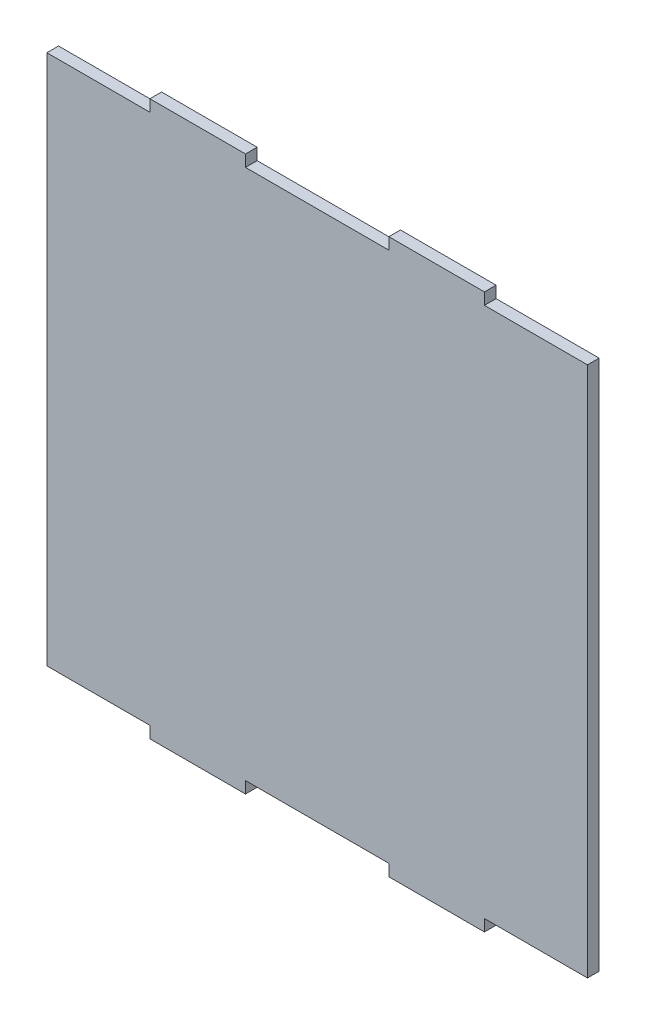
ISO-10303-21;
HEADER;
FILE_DESCRIPTION(('STEP AP214'),'2;1');
FILE_NAME('part.step','',(''),(''),'','','');
FILE_SCHEMA(('AUTOMOTIVE_DESIGN { 1 0 10303 214 1 1 1 1 }'));
ENDSEC;
DATA;
#1=APPLICATION_CONTEXT('core data for automotive mechanical design processes');
#2=APPLICATION_PROTOCOL_DEFINITION('international standard','automotive_design',2000,#1);
#3=PRODUCT_CONTEXT('',#1,'mechanical');
#4=PRODUCT('Part','Part','',(#3));
#5=PRODUCT_RELATED_PRODUCT_CATEGORY('part','',(#4));
#6=PRODUCT_DEFINITION_FORMATION('','',#4);
#7=PRODUCT_DEFINITION_CONTEXT('part definition',#1,'design');
#8=PRODUCT_DEFINITION('design','',#6,#7);
#9=PRODUCT_DEFINITION_SHAPE('','',#8);
#10=(LENGTH_UNIT() NAMED_UNIT(*) SI_UNIT(.MILLI.,.METRE.));
#11=(NAMED_UNIT(*) PLANE_ANGLE_UNIT() SI_UNIT($,.RADIAN.));
#12=(NAMED_UNIT(*) SI_UNIT($,.STERADIAN.) SOLID_ANGLE_UNIT());
#13=UNCERTAINTY_MEASURE_WITH_UNIT(LENGTH_MEASURE(1.E-05),#10,'distance_accuracy_value','');
#14=(GEOMETRIC_REPRESENTATION_CONTEXT(3) GLOBAL_UNCERTAINTY_ASSIGNED_CONTEXT((#13)) GLOBAL_UNIT_ASSIGNED_CONTEXT((#10,
#11,#12)) REPRESENTATION_CONTEXT('',''));
#15=CARTESIAN_POINT('',(0.,0.,0.));
#16=DIRECTION('',(0.,0.,1.));
#17=DIRECTION('',(1.,0.,0.));
#18=AXIS2_PLACEMENT_3D('',#15,#16,#17);
#19=CARTESIAN_POINT('',(35.,55.56,2.44));
#20=DIRECTION('',(0.,-1.,0.));
#21=DIRECTION('',(0.,0.,-1.));
#22=AXIS2_PLACEMENT_3D('',#19,#20,#21);
#23=PLANE('',#22);
#24=DIRECTION('',(-1.,0.,0.));
#25=VECTOR('',#24,1.);
#26=CARTESIAN_POINT('',(35.,55.56,0.));
#27=LINE('',#26,#25);
#28=CARTESIAN_POINT('',(56.56,55.56,0.));
#29=VERTEX_POINT('',#28);
#30=CARTESIAN_POINT('',(35.,55.56,0.));
#31=VERTEX_POINT('',#30);
#32=EDGE_CURVE('E202',#29,#31,#27,.T.);
#33=ORIENTED_EDGE('',*,*,#32,.T.);
#34=DIRECTION('',(0.,0.,-1.));
#35=VECTOR('',#34,1.);
#36=CARTESIAN_POINT('',(35.,55.56,2.44));
#37=LINE('',#36,#35);
#38=CARTESIAN_POINT('',(35.,55.56,2.44));
#39=VERTEX_POINT('',#38);
#40=EDGE_CURVE('E11',#39,#31,#37,.T.);
#41=ORIENTED_EDGE('',*,*,#40,.F.);
#42=DIRECTION('',(-1.,0.,0.));
#43=VECTOR('',#42,1.);
#44=CARTESIAN_POINT('',(35.,55.56,2.44));
#45=LINE('',#44,#43);
#46=CARTESIAN_POINT('',(56.56,55.56,2.44));
#47=VERTEX_POINT('',#46);
#48=EDGE_CURVE('E240',#47,#39,#45,.T.);
#49=ORIENTED_EDGE('',*,*,#48,.F.);
#50=DIRECTION('',(0.,0.,-1.));
#51=VECTOR('',#50,1.);
#52=CARTESIAN_POINT('',(56.56,55.56,2.44));
#53=LINE('',#52,#51);
#54=EDGE_CURVE('E198',#47,#29,#53,.T.);
#55=ORIENTED_EDGE('',*,*,#54,.T.);
#56=EDGE_LOOP('',(#33,#41,#49,#55));
#57=FACE_BOUND('',#56,.T.);
#58=ADVANCED_FACE('F34',(#57),#23,.F.);
#59=CARTESIAN_POINT('',(35.,58.,2.44));
#60=DIRECTION('',(-1.,0.,0.));
#61=DIRECTION('',(0.,0.,1.));
#62=AXIS2_PLACEMENT_3D('',#59,#60,#61);
#63=PLANE('',#62);
#64=DIRECTION('',(0.,1.,0.));
#65=VECTOR('',#64,1.);
#66=CARTESIAN_POINT('',(35.,58.,0.));
#67=LINE('',#66,#65);
#68=CARTESIAN_POINT('',(35.,58.,0.));
#69=VERTEX_POINT('',#68);
#70=EDGE_CURVE('E205',#31,#69,#67,.T.);
#71=ORIENTED_EDGE('',*,*,#70,.T.);
#72=DIRECTION('',(0.,0.,-1.));
#73=VECTOR('',#72,1.);
#74=CARTESIAN_POINT('',(35.,58.,2.44));
#75=LINE('',#74,#73);
#76=CARTESIAN_POINT('',(35.,58.,2.44));
#77=VERTEX_POINT('',#76);
#78=EDGE_CURVE('E42',#77,#69,#75,.T.);
#79=ORIENTED_EDGE('',*,*,#78,.F.);
#80=DIRECTION('',(0.,1.,0.));
#81=VECTOR('',#80,1.);
#82=CARTESIAN_POINT('',(35.,58.,2.44));
#83=LINE('',#82,#81);
#84=EDGE_CURVE('E129',#39,#77,#83,.T.);
#85=ORIENTED_EDGE('',*,*,#84,.F.);
#86=ORIENTED_EDGE('',*,*,#40,.T.);
#87=EDGE_LOOP('',(#71,#79,#85,#86));
#88=FACE_BOUND('',#87,.T.);
#89=ADVANCED_FACE('F358',(#88),#63,.F.);
#90=CARTESIAN_POINT('',(35.,58.,2.44));
#91=DIRECTION('',(0.,-1.,0.));
#92=DIRECTION('',(1.,0.,0.));
#93=AXIS2_PLACEMENT_3D('',#90,#91,#92);
#94=PLANE('',#93);
#95=DIRECTION('',(-1.,0.,0.));
#96=VECTOR('',#95,1.);
#97=CARTESIAN_POINT('',(35.,58.,0.));
#98=LINE('',#97,#96);
#99=CARTESIAN_POINT('',(15.,58.,0.));
#100=VERTEX_POINT('',#99);
#101=EDGE_CURVE('E207',#69,#100,#98,.T.);
#102=ORIENTED_EDGE('',*,*,#101,.T.);
#103=DIRECTION('',(0.,0.,-1.));
#104=VECTOR('',#103,1.);
#105=CARTESIAN_POINT('',(15.,58.,2.44));
#106=LINE('',#105,#104);
#107=CARTESIAN_POINT('',(15.,58.,2.44));
#108=VERTEX_POINT('',#107);
#109=EDGE_CURVE('E283',#108,#100,#106,.T.);
#110=ORIENTED_EDGE('',*,*,#109,.F.);
#111=DIRECTION('',(-1.,0.,0.));
#112=VECTOR('',#111,1.);
#113=CARTESIAN_POINT('',(35.,58.,2.44));
#114=LINE('',#113,#112);
#115=EDGE_CURVE('E291',#77,#108,#114,.T.);
#116=ORIENTED_EDGE('',*,*,#115,.F.);
#117=ORIENTED_EDGE('',*,*,#78,.T.);
#118=EDGE_LOOP('',(#102,#110,#116,#117));
#119=FACE_BOUND('',#118,.T.);
#120=ADVANCED_FACE('F289',(#119),#94,.F.);
#121=CARTESIAN_POINT('',(15.,58.,2.44));
#122=DIRECTION('',(1.,0.,0.));
#123=DIRECTION('',(0.,1.,0.));
#124=AXIS2_PLACEMENT_3D('',#121,#122,#123);
#125=PLANE('',#124);
#126=DIRECTION('',(0.,-1.,0.));
#127=VECTOR('',#126,1.);
#128=CARTESIAN_POINT('',(15.,58.,0.));
#129=LINE('',#128,#127);
#130=CARTESIAN_POINT('',(15.,55.56,0.));
#131=VERTEX_POINT('',#130);
#132=EDGE_CURVE('E209',#100,#131,#129,.T.);
#133=ORIENTED_EDGE('',*,*,#132,.T.);
#134=DIRECTION('',(0.,0.,-1.));
#135=VECTOR('',#134,1.);
#136=CARTESIAN_POINT('',(15.,55.56,2.44));
#137=LINE('',#136,#135);
#138=CARTESIAN_POINT('',(15.,55.56,2.44));
#139=VERTEX_POINT('',#138);
#140=EDGE_CURVE('E280',#139,#131,#137,.T.);
#141=ORIENTED_EDGE('',*,*,#140,.F.);
#142=DIRECTION('',(0.,-1.,0.));
#143=VECTOR('',#142,1.);
#144=CARTESIAN_POINT('',(15.,58.,2.44));
#145=LINE('',#144,#143);
#146=EDGE_CURVE('E309',#108,#139,#145,.T.);
#147=ORIENTED_EDGE('',*,*,#146,.F.);
#148=ORIENTED_EDGE('',*,*,#109,.T.);
#149=EDGE_LOOP('',(#133,#141,#147,#148));
#150=FACE_BOUND('',#149,.T.);
#151=ADVANCED_FACE('F300',(#150),#125,.F.);
#152=CARTESIAN_POINT('',(-15.,55.56,2.44));
#153=DIRECTION('',(0.,-1.,0.));
#154=DIRECTION('',(1.,0.,0.));
#155=AXIS2_PLACEMENT_3D('',#152,#153,#154);
#156=PLANE('',#155);
#157=DIRECTION('',(-1.,0.,0.));
#158=VECTOR('',#157,1.);
#159=CARTESIAN_POINT('',(-15.,55.56,0.));
#160=LINE('',#159,#158);
#161=CARTESIAN_POINT('',(-15.,55.56,0.));
#162=VERTEX_POINT('',#161);
#163=EDGE_CURVE('E211',#131,#162,#160,.T.);
#164=ORIENTED_EDGE('',*,*,#163,.T.);
#165=DIRECTION('',(0.,0.,-1.));
#166=VECTOR('',#165,1.);
#167=CARTESIAN_POINT('',(-15.,55.56,2.44));
#168=LINE('',#167,#166);
#169=CARTESIAN_POINT('',(-15.,55.56,2.44));
#170=VERTEX_POINT('',#169);
#171=EDGE_CURVE('E277',#170,#162,#168,.T.);
#172=ORIENTED_EDGE('',*,*,#171,.F.);
#173=DIRECTION('',(-1.,0.,0.));
#174=VECTOR('',#173,1.);
#175=CARTESIAN_POINT('',(-15.,55.56,2.44));
#176=LINE('',#175,#174);
#177=EDGE_CURVE('E306',#139,#170,#176,.T.);
#178=ORIENTED_EDGE('',*,*,#177,.F.);
#179=ORIENTED_EDGE('',*,*,#140,.T.);
#180=EDGE_LOOP('',(#164,#172,#178,#179));
#181=FACE_BOUND('',#180,.T.);
#182=ADVANCED_FACE('F304',(#181),#156,.F.);
#183=CARTESIAN_POINT('',(-14.9999999999999,58.,2.44));
#184=DIRECTION('',(-1.,0.,0.));
#185=DIRECTION('',(0.,-1.,0.));
#186=AXIS2_PLACEMENT_3D('',#183,#184,#185);
#187=PLANE('',#186);
#188=DIRECTION('',(0.,1.,0.));
#189=VECTOR('',#188,1.);
#190=CARTESIAN_POINT('',(-14.9999999999999,58.,0.));
#191=LINE('',#190,#189);
#192=CARTESIAN_POINT('',(-14.9999999999999,58.,0.));
#193=VERTEX_POINT('',#192);
#194=EDGE_CURVE('E213',#162,#193,#191,.T.);
#195=ORIENTED_EDGE('',*,*,#194,.T.);
#196=DIRECTION('',(0.,0.,-1.));
#197=VECTOR('',#196,1.);
#198=CARTESIAN_POINT('',(-14.9999999999999,58.,2.44));
#199=LINE('',#198,#197);
#200=CARTESIAN_POINT('',(-14.9999999999999,58.,2.44));
#201=VERTEX_POINT('',#200);
#202=EDGE_CURVE('E274',#201,#193,#199,.T.);
#203=ORIENTED_EDGE('',*,*,#202,.F.);
#204=DIRECTION('',(0.,1.,0.));
#205=VECTOR('',#204,1.);
#206=CARTESIAN_POINT('',(-14.9999999999999,58.,2.44));
#207=LINE('',#206,#205);
#208=EDGE_CURVE('E308',#170,#201,#207,.T.);
#209=ORIENTED_EDGE('',*,*,#208,.F.);
#210=ORIENTED_EDGE('',*,*,#171,.T.);
#211=EDGE_LOOP('',(#195,#203,#209,#210));
#212=FACE_BOUND('',#211,.T.);
#213=ADVANCED_FACE('F371',(#212),#187,.F.);
#214=CARTESIAN_POINT('',(-35.,58.,2.44));
#215=DIRECTION('',(0.,-1.,0.));
#216=DIRECTION('',(1.,0.,0.));
#217=AXIS2_PLACEMENT_3D('',#214,#215,#216);
#218=PLANE('',#217);
#219=DIRECTION('',(-1.,0.,0.));
#220=VECTOR('',#219,1.);
#221=CARTESIAN_POINT('',(-35.,58.,0.));
#222=LINE('',#221,#220);
#223=CARTESIAN_POINT('',(-35.,58.,0.));
#224=VERTEX_POINT('',#223);
#225=EDGE_CURVE('E215',#193,#224,#222,.T.);
#226=ORIENTED_EDGE('',*,*,#225,.T.);
#227=DIRECTION('',(0.,0.,-1.));
#228=VECTOR('',#227,1.);
#229=CARTESIAN_POINT('',(-35.,58.,2.44));
#230=LINE('',#229,#228);
#231=CARTESIAN_POINT('',(-35.,58.,2.44));
#232=VERTEX_POINT('',#231);
#233=EDGE_CURVE('E271',#232,#224,#230,.T.);
#234=ORIENTED_EDGE('',*,*,#233,.F.);
#235=DIRECTION('',(-1.,0.,0.));
#236=VECTOR('',#235,1.);
#237=CARTESIAN_POINT('',(-35.,58.,2.44));
#238=LINE('',#237,#236);
#239=EDGE_CURVE('E311',#201,#232,#238,.T.);
#240=ORIENTED_EDGE('',*,*,#239,.F.);
#241=ORIENTED_EDGE('',*,*,#202,.T.);
#242=EDGE_LOOP('',(#226,#234,#240,#241));
#243=FACE_BOUND('',#242,.T.);
#244=ADVANCED_FACE('F374',(#243),#218,.F.);
#245=CARTESIAN_POINT('',(-35.,58.,2.44));
#246=DIRECTION('',(1.,0.,0.));
#247=DIRECTION('',(0.,0.,-1.));
#248=AXIS2_PLACEMENT_3D('',#245,#246,#247);
#249=PLANE('',#248);
#250=DIRECTION('',(0.,-1.,0.));
#251=VECTOR('',#250,1.);
#252=CARTESIAN_POINT('',(-35.,58.,0.));
#253=LINE('',#252,#251);
#254=CARTESIAN_POINT('',(-35.,55.56,0.));
#255=VERTEX_POINT('',#254);
#256=EDGE_CURVE('E217',#224,#255,#253,.T.);
#257=ORIENTED_EDGE('',*,*,#256,.T.);
#258=DIRECTION('',(0.,0.,-1.));
#259=VECTOR('',#258,1.);
#260=CARTESIAN_POINT('',(-35.,55.56,2.44));
#261=LINE('',#260,#259);
#262=CARTESIAN_POINT('',(-35.,55.56,2.44));
#263=VERTEX_POINT('',#262);
#264=EDGE_CURVE('E268',#263,#255,#261,.T.);
#265=ORIENTED_EDGE('',*,*,#264,.F.);
#266=DIRECTION('',(0.,-1.,0.));
#267=VECTOR('',#266,1.);
#268=CARTESIAN_POINT('',(-35.,58.,2.44));
#269=LINE('',#268,#267);
#270=EDGE_CURVE('E317',#232,#263,#269,.T.);
#271=ORIENTED_EDGE('',*,*,#270,.F.);
#272=ORIENTED_EDGE('',*,*,#233,.T.);
#273=EDGE_LOOP('',(#257,#265,#271,#272));
#274=FACE_BOUND('',#273,.T.);
#275=ADVANCED_FACE('F378',(#274),#249,.F.);
#276=CARTESIAN_POINT('',(-56.56,55.56,2.44));
#277=DIRECTION('',(0.,-1.,0.));
#278=DIRECTION('',(1.,0.,0.));
#279=AXIS2_PLACEMENT_3D('',#276,#277,#278);
#280=PLANE('',#279);
#281=DIRECTION('',(-1.,0.,0.));
#282=VECTOR('',#281,1.);
#283=CARTESIAN_POINT('',(-56.56,55.56,0.));
#284=LINE('',#283,#282);
#285=CARTESIAN_POINT('',(-56.56,55.56,0.));
#286=VERTEX_POINT('',#285);
#287=EDGE_CURVE('E219',#255,#286,#284,.T.);
#288=ORIENTED_EDGE('',*,*,#287,.T.);
#289=DIRECTION('',(0.,0.,-1.));
#290=VECTOR('',#289,1.);
#291=CARTESIAN_POINT('',(-56.56,55.56,2.44));
#292=LINE('',#291,#290);
#293=CARTESIAN_POINT('',(-56.56,55.56,2.44));
#294=VERTEX_POINT('',#293);
#295=EDGE_CURVE('E265',#294,#286,#292,.T.);
#296=ORIENTED_EDGE('',*,*,#295,.F.);
#297=DIRECTION('',(-1.,0.,0.));
#298=VECTOR('',#297,1.);
#299=CARTESIAN_POINT('',(-56.56,55.56,2.44));
#300=LINE('',#299,#298);
#301=EDGE_CURVE('E319',#263,#294,#300,.T.);
#302=ORIENTED_EDGE('',*,*,#301,.F.);
#303=ORIENTED_EDGE('',*,*,#264,.T.);
#304=EDGE_LOOP('',(#288,#296,#302,#303));
#305=FACE_BOUND('',#304,.T.);
#306=ADVANCED_FACE('F382',(#305),#280,.F.);
#307=CARTESIAN_POINT('',(-56.56,-55.56,2.44));
#308=DIRECTION('',(1.,0.,0.));
#309=DIRECTION('',(0.,0.,-1.));
#310=AXIS2_PLACEMENT_3D('',#307,#308,#309);
#311=PLANE('',#310);
#312=DIRECTION('',(0.,-1.,0.));
#313=VECTOR('',#312,1.);
#314=CARTESIAN_POINT('',(-56.56,-55.56,0.));
#315=LINE('',#314,#313);
#316=CARTESIAN_POINT('',(-56.56,-55.56,0.));
#317=VERTEX_POINT('',#316);
#318=EDGE_CURVE('E221',#286,#317,#315,.T.);
#319=ORIENTED_EDGE('',*,*,#318,.T.);
#320=DIRECTION('',(0.,0.,-1.));
#321=VECTOR('',#320,1.);
#322=CARTESIAN_POINT('',(-56.56,-55.56,2.44));
#323=LINE('',#322,#321);
#324=CARTESIAN_POINT('',(-56.56,-55.56,2.44));
#325=VERTEX_POINT('',#324);
#326=EDGE_CURVE('E262',#325,#317,#323,.T.);
#327=ORIENTED_EDGE('',*,*,#326,.F.);
#328=DIRECTION('',(0.,-1.,0.));
#329=VECTOR('',#328,1.);
#330=CARTESIAN_POINT('',(-56.56,-55.56,2.44));
#331=LINE('',#330,#329);
#332=EDGE_CURVE('E321',#294,#325,#331,.T.);
#333=ORIENTED_EDGE('',*,*,#332,.F.);
#334=ORIENTED_EDGE('',*,*,#295,.T.);
#335=EDGE_LOOP('',(#319,#327,#333,#334));
#336=FACE_BOUND('',#335,.T.);
#337=ADVANCED_FACE('F386',(#336),#311,.F.);
#338=CARTESIAN_POINT('',(-56.56,-55.56,2.44));
#339=DIRECTION('',(0.,1.,0.));
#340=DIRECTION('',(-1.,0.,0.));
#341=AXIS2_PLACEMENT_3D('',#338,#339,#340);
#342=PLANE('',#341);
#343=DIRECTION('',(1.,0.,0.));
#344=VECTOR('',#343,1.);
#345=CARTESIAN_POINT('',(-56.56,-55.56,0.));
#346=LINE('',#345,#344);
#347=CARTESIAN_POINT('',(-35.,-55.56,0.));
#348=VERTEX_POINT('',#347);
#349=EDGE_CURVE('E223',#317,#348,#346,.T.);
#350=ORIENTED_EDGE('',*,*,#349,.T.);
#351=DIRECTION('',(0.,0.,-1.));
#352=VECTOR('',#351,1.);
#353=CARTESIAN_POINT('',(-35.,-55.56,2.44));
#354=LINE('',#353,#352);
#355=CARTESIAN_POINT('',(-35.,-55.56,2.44));
#356=VERTEX_POINT('',#355);
#357=EDGE_CURVE('E259',#356,#348,#354,.T.);
#358=ORIENTED_EDGE('',*,*,#357,.F.);
#359=DIRECTION('',(1.,0.,0.));
#360=VECTOR('',#359,1.);
#361=CARTESIAN_POINT('',(-56.56,-55.56,2.44));
#362=LINE('',#361,#360);
#363=EDGE_CURVE('E323',#325,#356,#362,.T.);
#364=ORIENTED_EDGE('',*,*,#363,.F.);
#365=ORIENTED_EDGE('',*,*,#326,.T.);
#366=EDGE_LOOP('',(#350,#358,#364,#365));
#367=FACE_BOUND('',#366,.T.);
#368=ADVANCED_FACE('F390',(#367),#342,.F.);
#369=CARTESIAN_POINT('',(-35.,-58.,2.44));
#370=DIRECTION('',(1.,0.,0.));
#371=DIRECTION('',(0.,0.,-1.));
#372=AXIS2_PLACEMENT_3D('',#369,#370,#371);
#373=PLANE('',#372);
#374=DIRECTION('',(0.,-1.,0.));
#375=VECTOR('',#374,1.);
#376=CARTESIAN_POINT('',(-35.,-58.,0.));
#377=LINE('',#376,#375);
#378=CARTESIAN_POINT('',(-35.,-58.,0.));
#379=VERTEX_POINT('',#378);
#380=EDGE_CURVE('E225',#348,#379,#377,.T.);
#381=ORIENTED_EDGE('',*,*,#380,.T.);
#382=DIRECTION('',(0.,0.,-1.));
#383=VECTOR('',#382,1.);
#384=CARTESIAN_POINT('',(-35.,-58.,2.44));
#385=LINE('',#384,#383);
#386=CARTESIAN_POINT('',(-35.,-58.,2.44));
#387=VERTEX_POINT('',#386);
#388=EDGE_CURVE('E256',#387,#379,#385,.T.);
#389=ORIENTED_EDGE('',*,*,#388,.F.);
#390=DIRECTION('',(0.,-1.,0.));
#391=VECTOR('',#390,1.);
#392=CARTESIAN_POINT('',(-35.,-58.,2.44));
#393=LINE('',#392,#391);
#394=EDGE_CURVE('E325',#356,#387,#393,.T.);
#395=ORIENTED_EDGE('',*,*,#394,.F.);
#396=ORIENTED_EDGE('',*,*,#357,.T.);
#397=EDGE_LOOP('',(#381,#389,#395,#396));
#398=FACE_BOUND('',#397,.T.);
#399=ADVANCED_FACE('F394',(#398),#373,.F.);
#400=CARTESIAN_POINT('',(-35.,-58.,2.44));
#401=DIRECTION('',(0.,1.,0.));
#402=DIRECTION('',(-1.,0.,0.));
#403=AXIS2_PLACEMENT_3D('',#400,#401,#402);
#404=PLANE('',#403);
#405=DIRECTION('',(1.,0.,0.));
#406=VECTOR('',#405,1.);
#407=CARTESIAN_POINT('',(-35.,-58.,0.));
#408=LINE('',#407,#406);
#409=CARTESIAN_POINT('',(-15.,-58.,0.));
#410=VERTEX_POINT('',#409);
#411=EDGE_CURVE('E227',#379,#410,#408,.T.);
#412=ORIENTED_EDGE('',*,*,#411,.T.);
#413=DIRECTION('',(0.,0.,-1.));
#414=VECTOR('',#413,1.);
#415=CARTESIAN_POINT('',(-15.,-58.,2.44));
#416=LINE('',#415,#414);
#417=CARTESIAN_POINT('',(-15.,-58.,2.44));
#418=VERTEX_POINT('',#417);
#419=EDGE_CURVE('E253',#418,#410,#416,.T.);
#420=ORIENTED_EDGE('',*,*,#419,.F.);
#421=DIRECTION('',(1.,0.,0.));
#422=VECTOR('',#421,1.);
#423=CARTESIAN_POINT('',(-35.,-58.,2.44));
#424=LINE('',#423,#422);
#425=EDGE_CURVE('E327',#387,#418,#424,.T.);
#426=ORIENTED_EDGE('',*,*,#425,.F.);
#427=ORIENTED_EDGE('',*,*,#388,.T.);
#428=EDGE_LOOP('',(#412,#420,#426,#427));
#429=FACE_BOUND('',#428,.T.);
#430=ADVANCED_FACE('F398',(#429),#404,.F.);
#431=CARTESIAN_POINT('',(-15.,-58.,2.44));
#432=DIRECTION('',(-1.,0.,0.));
#433=DIRECTION('',(0.,-1.,0.));
#434=AXIS2_PLACEMENT_3D('',#431,#432,#433);
#435=PLANE('',#434);
#436=DIRECTION('',(0.,1.,0.));
#437=VECTOR('',#436,1.);
#438=CARTESIAN_POINT('',(-15.,-58.,0.));
#439=LINE('',#438,#437);
#440=CARTESIAN_POINT('',(-15.,-55.56,0.));
#441=VERTEX_POINT('',#440);
#442=EDGE_CURVE('E229',#410,#441,#439,.T.);
#443=ORIENTED_EDGE('',*,*,#442,.T.);
#444=DIRECTION('',(0.,0.,-1.));
#445=VECTOR('',#444,1.);
#446=CARTESIAN_POINT('',(-15.,-55.56,2.44));
#447=LINE('',#446,#445);
#448=CARTESIAN_POINT('',(-15.,-55.56,2.44));
#449=VERTEX_POINT('',#448);
#450=EDGE_CURVE('E250',#449,#441,#447,.T.);
#451=ORIENTED_EDGE('',*,*,#450,.F.);
#452=DIRECTION('',(0.,1.,0.));
#453=VECTOR('',#452,1.);
#454=CARTESIAN_POINT('',(-15.,-58.,2.44));
#455=LINE('',#454,#453);
#456=EDGE_CURVE('E329',#418,#449,#455,.T.);
#457=ORIENTED_EDGE('',*,*,#456,.F.);
#458=ORIENTED_EDGE('',*,*,#419,.T.);
#459=EDGE_LOOP('',(#443,#451,#457,#458));
#460=FACE_BOUND('',#459,.T.);
#461=ADVANCED_FACE('F402',(#460),#435,.F.);
#462=CARTESIAN_POINT('',(-15.,-55.56,2.44));
#463=DIRECTION('',(0.,1.,0.));
#464=DIRECTION('',(-1.,0.,0.));
#465=AXIS2_PLACEMENT_3D('',#462,#463,#464);
#466=PLANE('',#465);
#467=DIRECTION('',(1.,0.,0.));
#468=VECTOR('',#467,1.);
#469=CARTESIAN_POINT('',(-15.,-55.56,0.));
#470=LINE('',#469,#468);
#471=CARTESIAN_POINT('',(15.,-55.56,0.));
#472=VERTEX_POINT('',#471);
#473=EDGE_CURVE('E231',#441,#472,#470,.T.);
#474=ORIENTED_EDGE('',*,*,#473,.T.);
#475=DIRECTION('',(0.,0.,-1.));
#476=VECTOR('',#475,1.);
#477=CARTESIAN_POINT('',(15.,-55.56,2.44));
#478=LINE('',#477,#476);
#479=CARTESIAN_POINT('',(15.,-55.56,2.44));
#480=VERTEX_POINT('',#479);
#481=EDGE_CURVE('E247',#480,#472,#478,.T.);
#482=ORIENTED_EDGE('',*,*,#481,.F.);
#483=DIRECTION('',(1.,0.,0.));
#484=VECTOR('',#483,1.);
#485=CARTESIAN_POINT('',(-15.,-55.56,2.44));
#486=LINE('',#485,#484);
#487=EDGE_CURVE('E331',#449,#480,#486,.T.);
#488=ORIENTED_EDGE('',*,*,#487,.F.);
#489=ORIENTED_EDGE('',*,*,#450,.T.);
#490=EDGE_LOOP('',(#474,#482,#488,#489));
#491=FACE_BOUND('',#490,.T.);
#492=ADVANCED_FACE('F406',(#491),#466,.F.);
#493=CARTESIAN_POINT('',(15.,-58.,2.44));
#494=DIRECTION('',(1.,0.,0.));
#495=DIRECTION('',(0.,1.,0.));
#496=AXIS2_PLACEMENT_3D('',#493,#494,#495);
#497=PLANE('',#496);
#498=DIRECTION('',(0.,-1.,0.));
#499=VECTOR('',#498,1.);
#500=CARTESIAN_POINT('',(15.,-58.,0.));
#501=LINE('',#500,#499);
#502=CARTESIAN_POINT('',(15.,-58.,0.));
#503=VERTEX_POINT('',#502);
#504=EDGE_CURVE('E233',#472,#503,#501,.T.);
#505=ORIENTED_EDGE('',*,*,#504,.T.);
#506=DIRECTION('',(0.,0.,-1.));
#507=VECTOR('',#506,1.);
#508=CARTESIAN_POINT('',(15.,-58.,2.44));
#509=LINE('',#508,#507);
#510=CARTESIAN_POINT('',(15.,-58.,2.44));
#511=VERTEX_POINT('',#510);
#512=EDGE_CURVE('E244',#511,#503,#509,.T.);
#513=ORIENTED_EDGE('',*,*,#512,.F.);
#514=DIRECTION('',(0.,-1.,0.));
#515=VECTOR('',#514,1.);
#516=CARTESIAN_POINT('',(15.,-58.,2.44));
#517=LINE('',#516,#515);
#518=EDGE_CURVE('E333',#480,#511,#517,.T.);
#519=ORIENTED_EDGE('',*,*,#518,.F.);
#520=ORIENTED_EDGE('',*,*,#481,.T.);
#521=EDGE_LOOP('',(#505,#513,#519,#520));
#522=FACE_BOUND('',#521,.T.);
#523=ADVANCED_FACE('F339',(#522),#497,.F.);
#524=CARTESIAN_POINT('',(35.,-58.,2.44));
#525=DIRECTION('',(0.,1.,0.));
#526=DIRECTION('',(-1.,0.,0.));
#527=AXIS2_PLACEMENT_3D('',#524,#525,#526);
#528=PLANE('',#527);
#529=DIRECTION('',(1.,0.,0.));
#530=VECTOR('',#529,1.);
#531=CARTESIAN_POINT('',(35.,-58.,0.));
#532=LINE('',#531,#530);
#533=CARTESIAN_POINT('',(35.,-58.,0.));
#534=VERTEX_POINT('',#533);
#535=EDGE_CURVE('E235',#503,#534,#532,.T.);
#536=ORIENTED_EDGE('',*,*,#535,.T.);
#537=DIRECTION('',(0.,0.,-1.));
#538=VECTOR('',#537,1.);
#539=CARTESIAN_POINT('',(35.,-58.,2.44));
#540=LINE('',#539,#538);
#541=CARTESIAN_POINT('',(35.,-58.,2.44));
#542=VERTEX_POINT('',#541);
#543=EDGE_CURVE('E193',#542,#534,#540,.T.);
#544=ORIENTED_EDGE('',*,*,#543,.F.);
#545=DIRECTION('',(1.,0.,0.));
#546=VECTOR('',#545,1.);
#547=CARTESIAN_POINT('',(35.,-58.,2.44));
#548=LINE('',#547,#546);
#549=EDGE_CURVE('E184',#511,#542,#548,.T.);
#550=ORIENTED_EDGE('',*,*,#549,.F.);
#551=ORIENTED_EDGE('',*,*,#512,.T.);
#552=EDGE_LOOP('',(#536,#544,#550,#551));
#553=FACE_BOUND('',#552,.T.);
#554=ADVANCED_FACE('F343',(#553),#528,.F.);
#555=CARTESIAN_POINT('',(35.,-58.,2.44));
#556=DIRECTION('',(-1.,0.,0.));
#557=DIRECTION('',(0.,0.,1.));
#558=AXIS2_PLACEMENT_3D('',#555,#556,#557);
#559=PLANE('',#558);
#560=DIRECTION('',(0.,1.,0.));
#561=VECTOR('',#560,1.);
#562=CARTESIAN_POINT('',(35.,-58.,0.));
#563=LINE('',#562,#561);
#564=CARTESIAN_POINT('',(35.,-55.56,0.));
#565=VERTEX_POINT('',#564);
#566=EDGE_CURVE('E192',#534,#565,#563,.T.);
#567=ORIENTED_EDGE('',*,*,#566,.T.);
#568=DIRECTION('',(0.,0.,-1.));
#569=VECTOR('',#568,1.);
#570=CARTESIAN_POINT('',(35.,-55.56,2.44));
#571=LINE('',#570,#569);
#572=CARTESIAN_POINT('',(35.,-55.56,2.44));
#573=VERTEX_POINT('',#572);
#574=EDGE_CURVE('E189',#573,#565,#571,.T.);
#575=ORIENTED_EDGE('',*,*,#574,.F.);
#576=DIRECTION('',(0.,1.,0.));
#577=VECTOR('',#576,1.);
#578=CARTESIAN_POINT('',(35.,-58.,2.44));
#579=LINE('',#578,#577);
#580=EDGE_CURVE('E178',#542,#573,#579,.T.);
#581=ORIENTED_EDGE('',*,*,#580,.F.);
#582=ORIENTED_EDGE('',*,*,#543,.T.);
#583=EDGE_LOOP('',(#567,#575,#581,#582));
#584=FACE_BOUND('',#583,.T.);
#585=ADVANCED_FACE('F190',(#584),#559,.F.);
#586=CARTESIAN_POINT('',(35.,-55.56,2.44));
#587=DIRECTION('',(0.,1.,0.));
#588=DIRECTION('',(0.,0.,1.));
#589=AXIS2_PLACEMENT_3D('',#586,#587,#588);
#590=PLANE('',#589);
#591=DIRECTION('',(1.,0.,0.));
#592=VECTOR('',#591,1.);
#593=CARTESIAN_POINT('',(35.,-55.56,0.));
#594=LINE('',#593,#592);
#595=CARTESIAN_POINT('',(56.56,-55.56,0.));
#596=VERTEX_POINT('',#595);
#597=EDGE_CURVE('E115',#565,#596,#594,.T.);
#598=ORIENTED_EDGE('',*,*,#597,.T.);
#599=DIRECTION('',(0.,0.,-1.));
#600=VECTOR('',#599,1.);
#601=CARTESIAN_POINT('',(56.56,-55.56,2.44));
#602=LINE('',#601,#600);
#603=CARTESIAN_POINT('',(56.56,-55.56,2.44));
#604=VERTEX_POINT('',#603);
#605=EDGE_CURVE('E194',#604,#596,#602,.T.);
#606=ORIENTED_EDGE('',*,*,#605,.F.);
#607=DIRECTION('',(1.,0.,0.));
#608=VECTOR('',#607,1.);
#609=CARTESIAN_POINT('',(35.,-55.56,2.44));
#610=LINE('',#609,#608);
#611=EDGE_CURVE('E182',#573,#604,#610,.T.);
#612=ORIENTED_EDGE('',*,*,#611,.F.);
#613=ORIENTED_EDGE('',*,*,#574,.T.);
#614=EDGE_LOOP('',(#598,#606,#612,#613));
#615=FACE_BOUND('',#614,.T.);
#616=ADVANCED_FACE('F196',(#615),#590,.F.);
#617=CARTESIAN_POINT('',(56.56,-55.56,2.44));
#618=DIRECTION('',(-1.,0.,0.));
#619=DIRECTION('',(0.,0.,1.));
#620=AXIS2_PLACEMENT_3D('',#617,#618,#619);
#621=PLANE('',#620);
#622=DIRECTION('',(0.,1.,0.));
#623=VECTOR('',#622,1.);
#624=CARTESIAN_POINT('',(56.56,-55.56,0.));
#625=LINE('',#624,#623);
#626=EDGE_CURVE('E121',#596,#29,#625,.T.);
#627=ORIENTED_EDGE('',*,*,#626,.T.);
#628=ORIENTED_EDGE('',*,*,#54,.F.);
#629=DIRECTION('',(0.,1.,0.));
#630=VECTOR('',#629,1.);
#631=CARTESIAN_POINT('',(56.56,-55.56,2.44));
#632=LINE('',#631,#630);
#633=EDGE_CURVE('E50',#604,#47,#632,.T.);
#634=ORIENTED_EDGE('',*,*,#633,.F.);
#635=ORIENTED_EDGE('',*,*,#605,.T.);
#636=EDGE_LOOP('',(#627,#628,#634,#635));
#637=FACE_BOUND('',#636,.T.);
#638=ADVANCED_FACE('F347',(#637),#621,.F.);
#639=CARTESIAN_POINT('',(0.,0.,2.44));
#640=DIRECTION('',(0.,0.,1.));
#641=DIRECTION('',(1.,0.,0.));
#642=AXIS2_PLACEMENT_3D('',#639,#640,#641);
#643=PLANE('',#642);
#644=ORIENTED_EDGE('',*,*,#48,.T.);
#645=ORIENTED_EDGE('',*,*,#84,.T.);
#646=ORIENTED_EDGE('',*,*,#115,.T.);
#647=ORIENTED_EDGE('',*,*,#146,.T.);
#648=ORIENTED_EDGE('',*,*,#177,.T.);
#649=ORIENTED_EDGE('',*,*,#208,.T.);
#650=ORIENTED_EDGE('',*,*,#239,.T.);
#651=ORIENTED_EDGE('',*,*,#270,.T.);
#652=ORIENTED_EDGE('',*,*,#301,.T.);
#653=ORIENTED_EDGE('',*,*,#332,.T.);
#654=ORIENTED_EDGE('',*,*,#363,.T.);
#655=ORIENTED_EDGE('',*,*,#394,.T.);
#656=ORIENTED_EDGE('',*,*,#425,.T.);
#657=ORIENTED_EDGE('',*,*,#456,.T.);
#658=ORIENTED_EDGE('',*,*,#487,.T.);
#659=ORIENTED_EDGE('',*,*,#518,.T.);
#660=ORIENTED_EDGE('',*,*,#549,.T.);
#661=ORIENTED_EDGE('',*,*,#580,.T.);
#662=ORIENTED_EDGE('',*,*,#611,.T.);
#663=ORIENTED_EDGE('',*,*,#633,.T.);
#664=EDGE_LOOP('',(#644,#645,#646,#647,#648,#649,#650,#651,#652,#653,#654,#655,#656,#657,#658,
#659,#660,#661,#662,#663));
#665=FACE_BOUND('',#664,.T.);
#666=ADVANCED_FACE('F180',(#665),#643,.T.);
#667=CARTESIAN_POINT('',(0.,0.,0.));
#668=DIRECTION('',(0.,0.,1.));
#669=DIRECTION('',(1.,0.,0.));
#670=AXIS2_PLACEMENT_3D('',#667,#668,#669);
#671=PLANE('',#670);
#672=ORIENTED_EDGE('',*,*,#32,.F.);
#673=ORIENTED_EDGE('',*,*,#626,.F.);
#674=ORIENTED_EDGE('',*,*,#597,.F.);
#675=ORIENTED_EDGE('',*,*,#566,.F.);
#676=ORIENTED_EDGE('',*,*,#535,.F.);
#677=ORIENTED_EDGE('',*,*,#504,.F.);
#678=ORIENTED_EDGE('',*,*,#473,.F.);
#679=ORIENTED_EDGE('',*,*,#442,.F.);
#680=ORIENTED_EDGE('',*,*,#411,.F.);
#681=ORIENTED_EDGE('',*,*,#380,.F.);
#682=ORIENTED_EDGE('',*,*,#349,.F.);
#683=ORIENTED_EDGE('',*,*,#318,.F.);
#684=ORIENTED_EDGE('',*,*,#287,.F.);
#685=ORIENTED_EDGE('',*,*,#256,.F.);
#686=ORIENTED_EDGE('',*,*,#225,.F.);
#687=ORIENTED_EDGE('',*,*,#194,.F.);
#688=ORIENTED_EDGE('',*,*,#163,.F.);
#689=ORIENTED_EDGE('',*,*,#132,.F.);
#690=ORIENTED_EDGE('',*,*,#101,.F.);
#691=ORIENTED_EDGE('',*,*,#70,.F.);
#692=EDGE_LOOP('',(#672,#673,#674,#675,#676,#677,#678,#679,#680,#681,#682,#683,#684,#685,#686,
#687,#688,#689,#690,#691));
#693=FACE_BOUND('',#692,.T.);
#694=ADVANCED_FACE('F295',(#693),#671,.F.);
#695=CLOSED_SHELL('',(#58,#89,#120,#151,#182,#213,#244,#275,#306,#337,#368,#399,#430,#461,#492,
#523,#554,#585,#616,#638,#666,#694));
#696=MANIFOLD_SOLID_BREP('B2',#695);
#697=ADVANCED_BREP_SHAPE_REPRESENTATION('',(#18,#696),#14);
#698=SHAPE_DEFINITION_REPRESENTATION(#9,#697);
ENDSEC;
END-ISO-10303-21;
